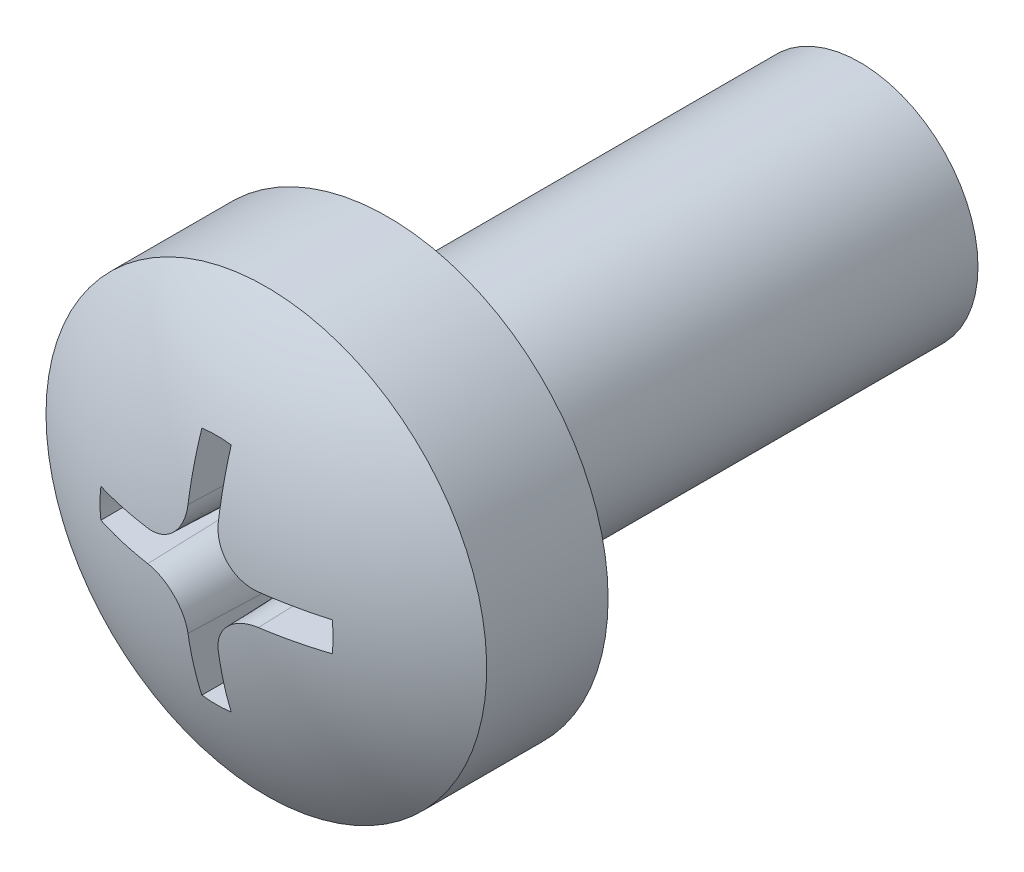
ISO-10303-21;
HEADER;
FILE_DESCRIPTION(('STEP AP214'),'2;1');
FILE_NAME('part.step','',(''),(''),'','','');
FILE_SCHEMA(('AUTOMOTIVE_DESIGN { 1 0 10303 214 1 1 1 1 }'));
ENDSEC;
DATA;
#1=APPLICATION_CONTEXT('core data for automotive mechanical design processes');
#2=APPLICATION_PROTOCOL_DEFINITION('international standard','automotive_design',2000,#1);
#3=PRODUCT_CONTEXT('',#1,'mechanical');
#4=PRODUCT('Part','Part','',(#3));
#5=PRODUCT_RELATED_PRODUCT_CATEGORY('part','',(#4));
#6=PRODUCT_DEFINITION_FORMATION('','',#4);
#7=PRODUCT_DEFINITION_CONTEXT('part definition',#1,'design');
#8=PRODUCT_DEFINITION('design','',#6,#7);
#9=PRODUCT_DEFINITION_SHAPE('','',#8);
#10=(LENGTH_UNIT() NAMED_UNIT(*) SI_UNIT(.MILLI.,.METRE.));
#11=(NAMED_UNIT(*) PLANE_ANGLE_UNIT() SI_UNIT($,.RADIAN.));
#12=(NAMED_UNIT(*) SI_UNIT($,.STERADIAN.) SOLID_ANGLE_UNIT());
#13=UNCERTAINTY_MEASURE_WITH_UNIT(LENGTH_MEASURE(1.E-05),#10,'distance_accuracy_value','');
#14=(GEOMETRIC_REPRESENTATION_CONTEXT(3) GLOBAL_UNCERTAINTY_ASSIGNED_CONTEXT((#13)) GLOBAL_UNIT_ASSIGNED_CONTEXT((#10,
#11,#12)) REPRESENTATION_CONTEXT('',''));
#15=CARTESIAN_POINT('',(0.,0.,0.));
#16=DIRECTION('',(0.,0.,1.));
#17=DIRECTION('',(1.,0.,0.));
#18=AXIS2_PLACEMENT_3D('',#15,#16,#17);
#19=CARTESIAN_POINT('',(0.,0.,6.));
#20=DIRECTION('',(0.,0.,-1.));
#21=DIRECTION('',(-1.,0.,0.));
#22=AXIS2_PLACEMENT_3D('',#19,#20,#21);
#23=CYLINDRICAL_SURFACE('',#22,1.5);
#24=CARTESIAN_POINT('',(0.,0.,6.));
#25=DIRECTION('',(0.,0.,1.));
#26=DIRECTION('',(1.,0.,0.));
#27=AXIS2_PLACEMENT_3D('',#24,#25,#26);
#28=CIRCLE('',#27,1.5);
#29=CARTESIAN_POINT('',(1.5,0.,6.));
#30=VERTEX_POINT('',#29);
#31=EDGE_CURVE('E206',#30,#30,#28,.T.);
#32=ORIENTED_EDGE('',*,*,#31,.F.);
#33=EDGE_LOOP('',(#32));
#34=FACE_BOUND('',#33,.T.);
#35=CARTESIAN_POINT('',(0.,0.,0.));
#36=DIRECTION('',(0.,0.,1.));
#37=DIRECTION('',(1.,0.,0.));
#38=AXIS2_PLACEMENT_3D('',#35,#36,#37);
#39=CIRCLE('',#38,1.5);
#40=CARTESIAN_POINT('',(1.5,0.,0.));
#41=VERTEX_POINT('',#40);
#42=EDGE_CURVE('E205',#41,#41,#39,.T.);
#43=ORIENTED_EDGE('',*,*,#42,.T.);
#44=EDGE_LOOP('',(#43));
#45=FACE_BOUND('',#44,.T.);
#46=ADVANCED_FACE('F34',(#34,#45),#23,.T.);
#47=CARTESIAN_POINT('',(0.,0.,0.));
#48=DIRECTION('',(0.,0.,1.));
#49=DIRECTION('',(1.,0.,0.));
#50=AXIS2_PLACEMENT_3D('',#47,#48,#49);
#51=PLANE('',#50);
#52=ORIENTED_EDGE('',*,*,#42,.F.);
#53=EDGE_LOOP('',(#52));
#54=FACE_BOUND('',#53,.T.);
#55=ADVANCED_FACE('F295',(#54),#51,.F.);
#56=CARTESIAN_POINT('',(0.,0.,6.));
#57=DIRECTION('',(0.,0.,-1.));
#58=DIRECTION('',(-1.,0.,0.));
#59=AXIS2_PLACEMENT_3D('',#56,#57,#58);
#60=PLANE('',#59);
#61=CARTESIAN_POINT('',(0.,0.,6.));
#62=DIRECTION('',(0.,0.,-1.));
#63=DIRECTION('',(-1.,0.,0.));
#64=AXIS2_PLACEMENT_3D('',#61,#62,#63);
#65=CIRCLE('',#64,2.79999990016222);
#66=CARTESIAN_POINT('',(-2.79999990016222,0.,6.));
#67=VERTEX_POINT('',#66);
#68=EDGE_CURVE('E202',#67,#67,#65,.T.);
#69=ORIENTED_EDGE('',*,*,#68,.T.);
#70=EDGE_LOOP('',(#69));
#71=FACE_BOUND('',#70,.T.);
#72=ORIENTED_EDGE('',*,*,#31,.T.);
#73=EDGE_LOOP('',(#72));
#74=FACE_BOUND('',#73,.T.);
#75=ADVANCED_FACE('F300',(#71,#74),#60,.T.);
#76=CARTESIAN_POINT('',(0.,0.,-0.393620134621003));
#77=DIRECTION('',(0.,0.,-1.));
#78=DIRECTION('',(-1.,0.,0.));
#79=AXIS2_PLACEMENT_3D('',#76,#77,#78);
#80=CYLINDRICAL_SURFACE('',#79,2.79999990016222);
#81=CARTESIAN_POINT('',(0.,0.,7.54246307978926));
#82=DIRECTION('',(0.,0.,-1.));
#83=DIRECTION('',(-1.,0.,0.));
#84=AXIS2_PLACEMENT_3D('',#81,#82,#83);
#85=CIRCLE('',#84,2.79999990016222);
#86=CARTESIAN_POINT('',(-2.79999990016222,0.,7.54246307978926));
#87=VERTEX_POINT('',#86);
#88=EDGE_CURVE('E150',#87,#87,#85,.T.);
#89=ORIENTED_EDGE('',*,*,#88,.T.);
#90=EDGE_LOOP('',(#89));
#91=FACE_BOUND('',#90,.T.);
#92=ORIENTED_EDGE('',*,*,#68,.F.);
#93=EDGE_LOOP('',(#92));
#94=FACE_BOUND('',#93,.T.);
#95=ADVANCED_FACE('F307',(#91,#94),#80,.T.);
#96=CARTESIAN_POINT('',(0.,0.,3.40000011175871));
#97=DIRECTION('',(0.,0.,-1.));
#98=DIRECTION('',(1.,0.,0.));
#99=AXIS2_PLACEMENT_3D('',#96,#97,#98);
#100=SPHERICAL_SURFACE('',#99,4.99999988824129);
#101=CARTESIAN_POINT('',(0.,0.,8.17541838215017));
#102=DIRECTION('',(0.,0.,-1.));
#103=DIRECTION('',(-1.,0.,0.));
#104=AXIS2_PLACEMENT_3D('',#101,#102,#103);
#105=CIRCLE('',#104,1.4816812157899);
#106=CARTESIAN_POINT('',(0.18668120666759,1.46987392394782,8.17541838215014));
#107=VERTEX_POINT('',#106);
#108=CARTESIAN_POINT('',(-0.186681206667593,1.46987392394782,8.17541838215014));
#109=VERTEX_POINT('',#108);
#110=EDGE_CURVE('E11',#107,#109,#105,.F.);
#111=ORIENTED_EDGE('',*,*,#110,.F.);
#112=CARTESIAN_POINT('',(0.0198956640512633,0.,3.39930533986049));
#113=DIRECTION('',(0.999390827019096,0.,-0.034899496702501));
#114=DIRECTION('',(-0.034899496702501,0.,-0.999390827019096));
#115=AXIS2_PLACEMENT_3D('',#112,#113,#114);
#116=CIRCLE('',#115,4.99996025606773);
#117=CARTESIAN_POINT('',(0.192632610704328,0.708178557647151,8.34584429553512));
#118=VERTEX_POINT('',#117);
#119=EDGE_CURVE('E41',#107,#118,#116,.T.);
#120=ORIENTED_EDGE('',*,*,#119,.T.);
#121=CARTESIAN_POINT('',(0.192631650862954,0.708378557647151,8.34581569147501));
#122=CARTESIAN_POINT('',(0.192737639690806,0.679822741796073,8.34990414397343));
#123=CARTESIAN_POINT('',(0.195268867839181,0.651227392830895,8.35364633624144));
#124=CARTESIAN_POINT('',(0.205046889209158,0.594767038274589,8.36034605517117));
#125=CARTESIAN_POINT('',(0.212292618678018,0.566901869404939,8.36330375862851));
#126=CARTESIAN_POINT('',(0.231373694375068,0.51267267841366,8.36834660632538));
#127=CARTESIAN_POINT('',(0.24321326807329,0.486310064716558,8.37043094316672));
#128=CARTESIAN_POINT('',(0.271156607880554,0.435900324544808,8.37366034910124));
#129=CARTESIAN_POINT('',(0.287258672100205,0.411852279143785,8.37480579232145));
#130=CARTESIAN_POINT('',(0.323072075489885,0.367028886470806,8.37611580257173));
#131=CARTESIAN_POINT('',(0.342740648168188,0.346219679514825,8.37629128935958));
#132=CARTESIAN_POINT('',(0.385246757538768,0.30814670944778,8.37568534569509));
#133=CARTESIAN_POINT('',(0.408084792807392,0.290883505206881,8.37490376453834));
#134=CARTESIAN_POINT('',(0.456147210008961,0.260464262414973,8.37241339517053));
#135=CARTESIAN_POINT('',(0.481359759209805,0.247289131136678,8.37070902247328));
#136=CARTESIAN_POINT('',(0.533541444049374,0.225283958921734,8.36642588708089));
#137=CARTESIAN_POINT('',(0.560509920861878,0.216452298826715,8.36384745082543));
#138=CARTESIAN_POINT('',(0.606876295057338,0.205379627868596,8.35882076515575));
#139=CARTESIAN_POINT('',(0.626020977094074,0.201943221890058,8.35658129607485));
#140=CARTESIAN_POINT('',(0.664502044043211,0.197253494550335,8.3517582366185));
#141=CARTESIAN_POINT('',(0.683838077649067,0.195996727127303,8.349175196413));
#142=CARTESIAN_POINT('',(0.703167546290468,0.195835015722444,8.34643346629546));
#143=B_SPLINE_CURVE_WITH_KNOTS('',3,(#121,#122,#123,#124,#125,#126,#127,#128,#129,#130,#131,
#132,#133,#134,#135,#136,#137,#138,#139,#140,#141,#142),.UNSPECIFIED.,.F.,.F.,(4,2,2,2,2,2,2,2,
2,2,4),(0.,0.0864417829586746,0.172864068455127,0.259366073122685,0.345833591994609,
0.431325646912079,0.516831165542017,0.601931114274005,0.686999315371811,0.745618262708562,
0.804144447281415),.UNSPECIFIED.);
#144=CARTESIAN_POINT('',(0.702917362553185,0.19583721033533,8.3464689381926));
#145=VERTEX_POINT('',#144);
#146=EDGE_CURVE('E277',#118,#145,#143,.T.);
#147=ORIENTED_EDGE('',*,*,#146,.T.);
#148=CARTESIAN_POINT('',(0.000105390153350939,0.0259265633149154,3.39909472873738));
#149=DIRECTION('',(0.00406243901494415,0.999382570249833,-0.034899496702501));
#150=DIRECTION('',(0.,0.0348997846864301,0.999390816962434));
#151=AXIS2_PLACEMENT_3D('',#148,#149,#150);
#152=CIRCLE('',#151,4.99993258603575);
#153=CARTESIAN_POINT('',(1.46986565043204,0.186746338396853,8.17541838215017));
#154=VERTEX_POINT('',#153);
#155=EDGE_CURVE('E275',#154,#145,#152,.F.);
#156=ORIENTED_EDGE('',*,*,#155,.F.);
#157=CARTESIAN_POINT('',(0.,0.,8.17541838215017));
#158=DIRECTION('',(0.,0.,-1.));
#159=DIRECTION('',(-1.,0.,0.));
#160=AXIS2_PLACEMENT_3D('',#157,#158,#159);
#161=CIRCLE('',#160,1.4816812157899);
#162=CARTESIAN_POINT('',(1.46986565043204,-0.186746338396852,8.17541838215014));
#163=VERTEX_POINT('',#162);
#164=EDGE_CURVE('E273',#163,#154,#161,.F.);
#165=ORIENTED_EDGE('',*,*,#164,.F.);
#166=CARTESIAN_POINT('',(0.000105390153350971,-0.0259265633149168,3.39909472873738));
#167=DIRECTION('',(0.00406243901494512,-0.999382570249833,-0.034899496702501));
#168=DIRECTION('',(0.,0.0348997846864301,-0.999390816962434));
#169=AXIS2_PLACEMENT_3D('',#166,#167,#168);
#170=CIRCLE('',#169,4.99993258603575);
#171=CARTESIAN_POINT('',(0.702917362553185,-0.195837210335331,8.3464689381926));
#172=VERTEX_POINT('',#171);
#173=EDGE_CURVE('E270',#163,#172,#170,.T.);
#174=ORIENTED_EDGE('',*,*,#173,.T.);
#175=CARTESIAN_POINT('',(0.192631650862954,-0.708378557647152,8.34581569147501));
#176=CARTESIAN_POINT('',(0.192737639690806,-0.679822741796074,8.34990414397343));
#177=CARTESIAN_POINT('',(0.195268867839181,-0.651227392830896,8.35364633624144));
#178=CARTESIAN_POINT('',(0.205046889209158,-0.59476703827459,8.36034605517117));
#179=CARTESIAN_POINT('',(0.212292618678018,-0.56690186940494,8.36330375862851));
#180=CARTESIAN_POINT('',(0.231373694375068,-0.512672678413661,8.36834660632538));
#181=CARTESIAN_POINT('',(0.24321326807329,-0.486310064716559,8.37043094316672));
#182=CARTESIAN_POINT('',(0.271156607880554,-0.435900324544809,8.37366034910124));
#183=CARTESIAN_POINT('',(0.287258672100205,-0.411852279143786,8.37480579232145));
#184=CARTESIAN_POINT('',(0.323072075489885,-0.367028886470807,8.37611580257173));
#185=CARTESIAN_POINT('',(0.342740648168188,-0.346219679514826,8.37629128935958));
#186=CARTESIAN_POINT('',(0.385246757538768,-0.30814670944778,8.37568534569509));
#187=CARTESIAN_POINT('',(0.408084792807392,-0.290883505206882,8.37490376453834));
#188=CARTESIAN_POINT('',(0.456147210008961,-0.260464262414974,8.37241339517053));
#189=CARTESIAN_POINT('',(0.481359759209805,-0.247289131136679,8.37070902247328));
#190=CARTESIAN_POINT('',(0.533541444049374,-0.225283958921735,8.36642588708089));
#191=CARTESIAN_POINT('',(0.560509920861877,-0.216452298826716,8.36384745082543));
#192=CARTESIAN_POINT('',(0.606876295057338,-0.205379627868597,8.35882076515575));
#193=CARTESIAN_POINT('',(0.626020977094074,-0.201943221890059,8.35658129607485));
#194=CARTESIAN_POINT('',(0.66450204404321,-0.197253494550336,8.3517582366185));
#195=CARTESIAN_POINT('',(0.683838077649067,-0.195996727127304,8.349175196413));
#196=CARTESIAN_POINT('',(0.703167546290467,-0.195835015722445,8.34643346629546));
#197=B_SPLINE_CURVE_WITH_KNOTS('',3,(#175,#176,#177,#178,#179,#180,#181,#182,#183,#184,#185,
#186,#187,#188,#189,#190,#191,#192,#193,#194,#195,#196),.UNSPECIFIED.,.F.,.F.,(4,2,2,2,2,2,2,2,
2,2,4),(0.,0.0864417829586746,0.172864068455127,0.259366073122685,0.345833591994609,
0.431325646912079,0.516831165542017,0.601931114274005,0.686999315371811,0.745618262708562,
0.804144447281415),.UNSPECIFIED.);
#198=CARTESIAN_POINT('',(0.192632610704328,-0.708178557647152,8.34584429553512));
#199=VERTEX_POINT('',#198);
#200=EDGE_CURVE('E264',#199,#172,#197,.T.);
#201=ORIENTED_EDGE('',*,*,#200,.F.);
#202=CARTESIAN_POINT('',(0.0198956640512633,0.,3.39930533986049));
#203=DIRECTION('',(0.999390827019096,0.,-0.034899496702501));
#204=DIRECTION('',(-0.034899496702501,0.,-0.999390827019096));
#205=AXIS2_PLACEMENT_3D('',#202,#203,#204);
#206=CIRCLE('',#205,4.99996025606773);
#207=CARTESIAN_POINT('',(0.186681206667591,-1.46987392394782,8.17541838215017));
#208=VERTEX_POINT('',#207);
#209=EDGE_CURVE('E262',#208,#199,#206,.F.);
#210=ORIENTED_EDGE('',*,*,#209,.F.);
#211=CARTESIAN_POINT('',(0.,0.,8.17541838215017));
#212=DIRECTION('',(0.,0.,-1.));
#213=DIRECTION('',(-1.,0.,0.));
#214=AXIS2_PLACEMENT_3D('',#211,#212,#213);
#215=CIRCLE('',#214,1.4816812157899);
#216=CARTESIAN_POINT('',(-0.186681206667593,-1.46987392394782,8.17541838215014));
#217=VERTEX_POINT('',#216);
#218=EDGE_CURVE('E259',#208,#217,#215,.T.);
#219=ORIENTED_EDGE('',*,*,#218,.T.);
#220=CARTESIAN_POINT('',(-0.0198956640512654,0.,3.39930533986049));
#221=DIRECTION('',(-0.999390827019096,0.,-0.034899496702501));
#222=DIRECTION('',(-0.034899496702501,0.,0.999390827019096));
#223=AXIS2_PLACEMENT_3D('',#220,#221,#222);
#224=CIRCLE('',#223,4.99996025606773);
#225=CARTESIAN_POINT('',(-0.19263261070433,-0.708178557647151,8.34584429553512));
#226=VERTEX_POINT('',#225);
#227=EDGE_CURVE('E255',#217,#226,#224,.T.);
#228=ORIENTED_EDGE('',*,*,#227,.T.);
#229=CARTESIAN_POINT('',(-0.70316754629047,-0.195835015722445,8.34643346629546));
#230=CARTESIAN_POINT('',(-0.674619447950853,-0.196052963217916,8.35048572416475));
#231=CARTESIAN_POINT('',(-0.64604143463723,-0.198695168407334,8.35418904161906));
#232=CARTESIAN_POINT('',(-0.589634494727846,-0.208689654905481,8.36080680147558));
#233=CARTESIAN_POINT('',(-0.561805393198952,-0.216040826152062,8.36372142956822));
#234=CARTESIAN_POINT('',(-0.50766612082123,-0.235323893103952,8.36867508610456));
#235=CARTESIAN_POINT('',(-0.481357369172765,-0.247259991703852,8.370713307523));
#236=CARTESIAN_POINT('',(-0.431071022991569,-0.275383990623327,8.37384890996341));
#237=CARTESIAN_POINT('',(-0.407092510169895,-0.291570206692358,8.37494666294437));
#238=CARTESIAN_POINT('',(-0.362416703115867,-0.327538701485094,8.37616180832018));
#239=CARTESIAN_POINT('',(-0.34168588735275,-0.347278991317759,8.37628996638402));
#240=CARTESIAN_POINT('',(-0.303780328011577,-0.389912448398922,8.37559036471605));
#241=CARTESIAN_POINT('',(-0.286606147147996,-0.412806113607388,8.37476245385545));
#242=CARTESIAN_POINT('',(-0.25636685808405,-0.460969475916929,8.37218162580557));
#243=CARTESIAN_POINT('',(-0.243283863198687,-0.486228184526672,8.37043282748058));
#244=CARTESIAN_POINT('',(-0.22146899790456,-0.538485231439468,8.36606389829698));
#245=CARTESIAN_POINT('',(-0.212735526227358,-0.565482925398504,8.36344408869266));
#246=CARTESIAN_POINT('',(-0.201823996880683,-0.61191361527353,8.35834781298739));
#247=CARTESIAN_POINT('',(-0.198453223120025,-0.631098599357625,8.3560784464194));
#248=CARTESIAN_POINT('',(-0.193901764340931,-0.669652448873598,8.35119687303864));
#249=CARTESIAN_POINT('',(-0.192717622166763,-0.689020975292663,8.34858521441869));
#250=CARTESIAN_POINT('',(-0.192631650862956,-0.708378557647151,8.34581569147501));
#251=B_SPLINE_CURVE_WITH_KNOTS('',3,(#229,#230,#231,#232,#233,#234,#235,#236,#237,#238,#239,
#240,#241,#242,#243,#244,#245,#246,#247,#248,#249,#250),.UNSPECIFIED.,.F.,.F.,(4,2,2,2,2,2,2,2,
2,2,4),(0.,0.0864053436114193,0.172790326060609,0.259254685287909,0.34568483171133,
0.431153892876567,0.51663646625136,0.601739908197796,0.686811996276178,0.745524819849982,
0.804144736260156),.UNSPECIFIED.);
#252=CARTESIAN_POINT('',(-0.702917362553187,-0.195837210335331,8.3464689381926));
#253=VERTEX_POINT('',#252);
#254=EDGE_CURVE('E248',#253,#226,#251,.T.);
#255=ORIENTED_EDGE('',*,*,#254,.F.);
#256=CARTESIAN_POINT('',(-0.000105390153349066,-0.0259265633149167,3.39909472873738));
#257=DIRECTION('',(-0.0040624390149453,-0.999382570249833,-0.034899496702501));
#258=DIRECTION('',(0.,0.0348997846864301,-0.999390816962434));
#259=AXIS2_PLACEMENT_3D('',#256,#257,#258);
#260=CIRCLE('',#259,4.99993258603575);
#261=CARTESIAN_POINT('',(-1.46986565043204,-0.186746338396853,8.17541838215019));
#262=VERTEX_POINT('',#261);
#263=EDGE_CURVE('E256',#262,#253,#260,.F.);
#264=ORIENTED_EDGE('',*,*,#263,.F.);
#265=CARTESIAN_POINT('',(0.,0.,8.17541838215019));
#266=DIRECTION('',(0.,0.,-1.));
#267=DIRECTION('',(-1.,0.,0.));
#268=AXIS2_PLACEMENT_3D('',#265,#266,#267);
#269=CIRCLE('',#268,1.4816812157899);
#270=CARTESIAN_POINT('',(-1.46986565043204,0.186746338396852,8.17541838215014));
#271=VERTEX_POINT('',#270);
#272=EDGE_CURVE('E594',#262,#271,#269,.T.);
#273=ORIENTED_EDGE('',*,*,#272,.T.);
#274=CARTESIAN_POINT('',(-0.000105390153349066,0.0259265633149167,3.39909472873738));
#275=DIRECTION('',(-0.00406243901494529,0.999382570249833,-0.034899496702501));
#276=DIRECTION('',(0.,0.0348997846864301,0.999390816962434));
#277=AXIS2_PLACEMENT_3D('',#274,#275,#276);
#278=CIRCLE('',#277,4.99993258603575);
#279=CARTESIAN_POINT('',(-0.702917362553187,0.195837210335331,8.3464689381926));
#280=VERTEX_POINT('',#279);
#281=EDGE_CURVE('E221',#271,#280,#278,.T.);
#282=ORIENTED_EDGE('',*,*,#281,.T.);
#283=CARTESIAN_POINT('',(-0.192631650862955,0.708378557647151,8.34581569147501));
#284=CARTESIAN_POINT('',(-0.192737639690808,0.679822741796074,8.34990414397343));
#285=CARTESIAN_POINT('',(-0.195268867839183,0.651227392830896,8.35364633624144));
#286=CARTESIAN_POINT('',(-0.20504688920916,0.59476703827459,8.36034605517116));
#287=CARTESIAN_POINT('',(-0.21229261867802,0.566901869404939,8.36330375862851));
#288=CARTESIAN_POINT('',(-0.231373694375069,0.51267267841366,8.36834660632538));
#289=CARTESIAN_POINT('',(-0.243213268073292,0.486310064716559,8.37043094316672));
#290=CARTESIAN_POINT('',(-0.271156607880556,0.435900324544809,8.37366034910124));
#291=CARTESIAN_POINT('',(-0.287258672100207,0.411852279143786,8.37480579232145));
#292=CARTESIAN_POINT('',(-0.323072075489887,0.367028886470806,8.37611580257173));
#293=CARTESIAN_POINT('',(-0.34274064816819,0.346219679514826,8.37629128935957));
#294=CARTESIAN_POINT('',(-0.38524675753877,0.30814670944778,8.37568534569509));
#295=CARTESIAN_POINT('',(-0.408084792807394,0.290883505206882,8.37490376453834));
#296=CARTESIAN_POINT('',(-0.456147210008963,0.260464262414974,8.37241339517053));
#297=CARTESIAN_POINT('',(-0.481359759209807,0.247289131136679,8.37070902247328));
#298=CARTESIAN_POINT('',(-0.533541444049376,0.225283958921735,8.36642588708089));
#299=CARTESIAN_POINT('',(-0.560509920861879,0.216452298826716,8.36384745082543));
#300=CARTESIAN_POINT('',(-0.60687629505734,0.205379627868597,8.35882076515575));
#301=CARTESIAN_POINT('',(-0.626020977094076,0.201943221890059,8.35658129607485));
#302=CARTESIAN_POINT('',(-0.664502044043212,0.197253494550336,8.3517582366185));
#303=CARTESIAN_POINT('',(-0.683838077649068,0.195996727127304,8.349175196413));
#304=CARTESIAN_POINT('',(-0.703167546290469,0.195835015722445,8.34643346629546));
#305=B_SPLINE_CURVE_WITH_KNOTS('',3,(#283,#284,#285,#286,#287,#288,#289,#290,#291,#292,#293,
#294,#295,#296,#297,#298,#299,#300,#301,#302,#303,#304),.UNSPECIFIED.,.F.,.F.,(4,2,2,2,2,2,2,2,
2,2,4),(0.,0.0864417829586747,0.172864068455127,0.259366073122684,0.345833591994609,
0.431325646912079,0.516831165542016,0.601931114274005,0.686999315371811,0.745618262708562,
0.804144447281415),.UNSPECIFIED.);
#306=CARTESIAN_POINT('',(-0.19263261070433,0.708178557647151,8.34584429553512));
#307=VERTEX_POINT('',#306);
#308=EDGE_CURVE('E213',#307,#280,#305,.T.);
#309=ORIENTED_EDGE('',*,*,#308,.F.);
#310=CARTESIAN_POINT('',(-0.0198956640512643,0.,3.39930533986049));
#311=DIRECTION('',(-0.999390827019096,0.,-0.034899496702501));
#312=DIRECTION('',(-0.034899496702501,0.,0.999390827019096));
#313=AXIS2_PLACEMENT_3D('',#310,#311,#312);
#314=CIRCLE('',#313,4.99996025606773);
#315=EDGE_CURVE('E209',#109,#307,#314,.F.);
#316=ORIENTED_EDGE('',*,*,#315,.F.);
#317=EDGE_LOOP('',(#111,#120,#147,#156,#165,#174,#201,#210,#219,#228,#255,#264,#273,#282,#309,#316));
#318=FACE_BOUND('',#317,.T.);
#319=ORIENTED_EDGE('',*,*,#88,.F.);
#320=EDGE_LOOP('',(#319));
#321=FACE_BOUND('',#320,.T.);
#322=ADVANCED_FACE('F223',(#318,#321),#100,.T.);
#323=CARTESIAN_POINT('',(0.,0.,8.7000001));
#324=DIRECTION('',(0.,0.,1.));
#325=DIRECTION('',(1.,0.,0.));
#326=AXIS2_PLACEMENT_3D('',#323,#324,#325);
#327=CONICAL_SURFACE('',#326,1.50000001303852,0.0349065850398867);
#328=ORIENTED_EDGE('',*,*,#110,.T.);
#329=CARTESIAN_POINT('',(-0.142142619910814,1.43009594495933,6.90000013091991));
#330=CARTESIAN_POINT('',(-0.152618658076336,1.43957885994155,7.19999461322929));
#331=CARTESIAN_POINT('',(-0.163094792502732,1.4489727928664,7.49999185208944));
#332=CARTESIAN_POINT('',(-0.184047253837866,1.46758269456637,8.09999184178282));
#333=CARTESIAN_POINT('',(-0.194523580746602,1.47679866334215,8.39999459261603));
#334=CARTESIAN_POINT('',(-0.205000003916213,1.48592565006124,8.7000001));
#335=B_SPLINE_CURVE_WITH_KNOTS('',3,(#329,#330,#331,#332,#333,#334),.UNSPECIFIED.,.F.,.F.,(4,2,
4),(0.,0.900981158642231,1.80196231389533),.UNSPECIFIED.);
#336=CARTESIAN_POINT('',(-0.142142619910814,1.43009594495933,6.90000013091991));
#337=VERTEX_POINT('',#336);
#338=EDGE_CURVE('E48',#337,#109,#335,.T.);
#339=ORIENTED_EDGE('',*,*,#338,.F.);
#340=CARTESIAN_POINT('',(0.,0.,6.90000013091991));
#341=DIRECTION('',(0.,0.,1.));
#342=DIRECTION('',(1.,0.,0.));
#343=AXIS2_PLACEMENT_3D('',#340,#341,#342);
#344=CIRCLE('',#343,1.43714262903312);
#345=CARTESIAN_POINT('',(0.142142619910811,1.43009594495933,6.90000013091991));
#346=VERTEX_POINT('',#345);
#347=EDGE_CURVE('E158',#346,#337,#344,.T.);
#348=ORIENTED_EDGE('',*,*,#347,.F.);
#349=CARTESIAN_POINT('',(0.142142619910811,1.43009594495933,6.90000013091991));
#350=CARTESIAN_POINT('',(0.152618658076333,1.43957885994155,7.19999461322929));
#351=CARTESIAN_POINT('',(0.16309479250273,1.4489727928664,7.49999185208944));
#352=CARTESIAN_POINT('',(0.184047253837863,1.46758269456637,8.09999184178282));
#353=CARTESIAN_POINT('',(0.1945235807466,1.47679866334215,8.39999459261603));
#354=CARTESIAN_POINT('',(0.205000003916211,1.48592565006124,8.7000001));
#355=B_SPLINE_CURVE_WITH_KNOTS('',3,(#349,#350,#351,#352,#353,#354),.UNSPECIFIED.,.F.,.F.,(4,2,
4),(0.,0.900981158642231,1.80196231389533),.UNSPECIFIED.);
#356=EDGE_CURVE('E142',#346,#107,#355,.T.);
#357=ORIENTED_EDGE('',*,*,#356,.T.);
#358=EDGE_LOOP('',(#328,#339,#348,#357));
#359=FACE_BOUND('',#358,.T.);
#360=ADVANCED_FACE('F162',(#359),#327,.F.);
#361=CARTESIAN_POINT('',(0.205000003916211,1.48592565006124,8.7000001));
#362=DIRECTION('',(0.999390827019096,0.,-0.034899496702501));
#363=DIRECTION('',(-0.034899496702501,0.,-0.999390827019096));
#364=AXIS2_PLACEMENT_3D('',#361,#362,#363);
#365=PLANE('',#364);
#366=ORIENTED_EDGE('',*,*,#356,.F.);
#367=DIRECTION('',(0.,1.,0.));
#368=VECTOR('',#367,1.);
#369=CARTESIAN_POINT('',(0.142142619910812,0.,6.90000013091991));
#370=LINE('',#369,#368);
#371=CARTESIAN_POINT('',(0.142142619910811,0.708178557647151,6.90000013091991));
#372=VERTEX_POINT('',#371);
#373=EDGE_CURVE('E145',#346,#372,#370,.F.);
#374=ORIENTED_EDGE('',*,*,#373,.T.);
#375=DIRECTION('',(0.034899496702501,0.,0.999390827019096));
#376=VECTOR('',#375,1.);
#377=CARTESIAN_POINT('',(0.20500000391621,0.708178557647151,8.7000001));
#378=LINE('',#377,#376);
#379=EDGE_CURVE('E151',#372,#118,#378,.T.);
#380=ORIENTED_EDGE('',*,*,#379,.T.);
#381=ORIENTED_EDGE('',*,*,#119,.F.);
#382=EDGE_LOOP('',(#366,#374,#380,#381));
#383=FACE_BOUND('',#382,.T.);
#384=ADVANCED_FACE('F144',(#383),#365,.F.);
#385=CARTESIAN_POINT('',(0.705000003916211,0.708178557647151,8.7000001));
#386=DIRECTION('',(0.,0.,-1.));
#387=DIRECTION('',(1.,0.,0.));
#388=AXIS2_PLACEMENT_3D('',#385,#386,#387);
#389=CONICAL_SURFACE('',#388,0.5,0.0349065850398867);
#390=ORIENTED_EDGE('',*,*,#379,.F.);
#391=CARTESIAN_POINT('',(0.705000003916211,0.708178557647151,6.90000013091991));
#392=DIRECTION('',(0.,0.,1.));
#393=DIRECTION('',(1.,0.,0.));
#394=AXIS2_PLACEMENT_3D('',#391,#392,#393);
#395=CIRCLE('',#394,0.562857384005399);
#396=CARTESIAN_POINT('',(0.702712036351556,0.145325823858085,6.90000013091991));
#397=VERTEX_POINT('',#396);
#398=EDGE_CURVE('E160',#372,#397,#395,.T.);
#399=ORIENTED_EDGE('',*,*,#398,.T.);
#400=DIRECTION('',(0.000141863496415148,0.0348992083697649,0.999390827019096));
#401=VECTOR('',#400,1.);
#402=CARTESIAN_POINT('',(0.702967546290468,0.208182688548215,8.7000001));
#403=LINE('',#402,#401);
#404=EDGE_CURVE('E420',#397,#145,#403,.T.);
#405=ORIENTED_EDGE('',*,*,#404,.T.);
#406=ORIENTED_EDGE('',*,*,#146,.F.);
#407=EDGE_LOOP('',(#390,#399,#405,#406));
#408=FACE_BOUND('',#407,.T.);
#409=ADVANCED_FACE('F283',(#408),#389,.T.);
#410=CARTESIAN_POINT('',(1.48592565006123,0.205000003916213,8.7000001));
#411=DIRECTION('',(0.00406243901494415,0.999382570249833,-0.034899496702501));
#412=DIRECTION('',(0.,0.0348997846864301,0.999390816962434));
#413=AXIS2_PLACEMENT_3D('',#410,#411,#412);
#414=PLANE('',#413);
#415=ORIENTED_EDGE('',*,*,#155,.T.);
#416=ORIENTED_EDGE('',*,*,#404,.F.);
#417=DIRECTION('',(-0.99999173819787,0.00406491525148502,0.));
#418=VECTOR('',#417,1.);
#419=CARTESIAN_POINT('',(0.000602343564913371,0.148179863836023,6.90000013091991));
#420=LINE('',#419,#418);
#421=CARTESIAN_POINT('',(1.43007341244828,0.142369137079488,6.90000013091991));
#422=VERTEX_POINT('',#421);
#423=EDGE_CURVE('E171',#422,#397,#420,.T.);
#424=ORIENTED_EDGE('',*,*,#423,.F.);
#425=CARTESIAN_POINT('',(1.43007341244828,0.142369137079488,6.90000013091991));
#426=CARTESIAN_POINT('',(1.43955869120937,0.152806706922151,7.19999467904414));
#427=CARTESIAN_POINT('',(1.44895568373278,0.163244730756208,7.49999195080733));
#428=CARTESIAN_POINT('',(1.46757309626977,0.184121686368453,8.09999194050071));
#429=CARTESIAN_POINT('',(1.47679351628402,0.194560618146638,8.39999465843089));
#430=CARTESIAN_POINT('',(1.48592565006123,0.205000003916213,8.7000001));
#431=B_SPLINE_CURVE_WITH_KNOTS('',3,(#425,#426,#427,#428,#429,#430),.UNSPECIFIED.,.F.,.F.,(4,2,
4),(0.,0.900977563471274,1.80195512360615),.UNSPECIFIED.);
#432=EDGE_CURVE('E414',#422,#154,#431,.T.);
#433=ORIENTED_EDGE('',*,*,#432,.T.);
#434=EDGE_LOOP('',(#415,#416,#424,#433));
#435=FACE_BOUND('',#434,.T.);
#436=ADVANCED_FACE('F235',(#435),#414,.F.);
#437=CARTESIAN_POINT('',(0.,0.,8.7000001));
#438=DIRECTION('',(0.,0.,1.));
#439=DIRECTION('',(1.,0.,0.));
#440=AXIS2_PLACEMENT_3D('',#437,#438,#439);
#441=CONICAL_SURFACE('',#440,1.50000001303852,0.0349065850398867);
#442=ORIENTED_EDGE('',*,*,#164,.T.);
#443=ORIENTED_EDGE('',*,*,#432,.F.);
#444=CARTESIAN_POINT('',(0.,0.,6.90000013091991));
#445=DIRECTION('',(0.,0.,1.));
#446=DIRECTION('',(1.,0.,0.));
#447=AXIS2_PLACEMENT_3D('',#444,#445,#446);
#448=CIRCLE('',#447,1.43714262903312);
#449=CARTESIAN_POINT('',(1.43007341244828,-0.142369137079488,6.90000013091991));
#450=VERTEX_POINT('',#449);
#451=EDGE_CURVE('E173',#450,#422,#448,.T.);
#452=ORIENTED_EDGE('',*,*,#451,.F.);
#453=CARTESIAN_POINT('',(1.43007341244828,-0.142369137079488,6.90000013091991));
#454=CARTESIAN_POINT('',(1.43955869120937,-0.152806706922151,7.19999467904414));
#455=CARTESIAN_POINT('',(1.44895568373278,-0.163244730756208,7.49999195080733));
#456=CARTESIAN_POINT('',(1.46757309626977,-0.184121686368453,8.09999194050071));
#457=CARTESIAN_POINT('',(1.47679351628402,-0.194560618146638,8.39999465843089));
#458=CARTESIAN_POINT('',(1.48592565006123,-0.205000003916213,8.7000001));
#459=B_SPLINE_CURVE_WITH_KNOTS('',3,(#453,#454,#455,#456,#457,#458),.UNSPECIFIED.,.F.,.F.,(4,2,
4),(0.,0.900977563471274,1.80195512360615),.UNSPECIFIED.);
#460=EDGE_CURVE('E408',#450,#163,#459,.T.);
#461=ORIENTED_EDGE('',*,*,#460,.T.);
#462=EDGE_LOOP('',(#442,#443,#452,#461));
#463=FACE_BOUND('',#462,.T.);
#464=ADVANCED_FACE('F291',(#463),#441,.F.);
#465=CARTESIAN_POINT('',(1.48592565006123,-0.205000003916213,8.7000001));
#466=DIRECTION('',(0.00406243901494512,-0.999382570249833,-0.034899496702501));
#467=DIRECTION('',(0.,0.0348997846864301,-0.999390816962434));
#468=AXIS2_PLACEMENT_3D('',#465,#466,#467);
#469=PLANE('',#468);
#470=ORIENTED_EDGE('',*,*,#460,.F.);
#471=DIRECTION('',(0.99999173819787,0.00406491525148599,0.));
#472=VECTOR('',#471,1.);
#473=CARTESIAN_POINT('',(0.00060234356491352,-0.148179863836024,6.90000013091991));
#474=LINE('',#473,#472);
#475=CARTESIAN_POINT('',(0.702712036351556,-0.145325823858086,6.90000013091991));
#476=VERTEX_POINT('',#475);
#477=EDGE_CURVE('E176',#450,#476,#474,.F.);
#478=ORIENTED_EDGE('',*,*,#477,.T.);
#479=DIRECTION('',(0.000141863496415188,-0.0348992083697649,0.999390827019096));
#480=VECTOR('',#479,1.);
#481=CARTESIAN_POINT('',(0.702967546290468,-0.208182688548216,8.7000001));
#482=LINE('',#481,#480);
#483=EDGE_CURVE('E430',#476,#172,#482,.T.);
#484=ORIENTED_EDGE('',*,*,#483,.T.);
#485=ORIENTED_EDGE('',*,*,#173,.F.);
#486=EDGE_LOOP('',(#470,#478,#484,#485));
#487=FACE_BOUND('',#486,.T.);
#488=ADVANCED_FACE('F403',(#487),#469,.F.);
#489=CARTESIAN_POINT('',(0.705000003916211,-0.708178557647152,8.7000001));
#490=DIRECTION('',(0.,0.,-1.));
#491=DIRECTION('',(-1.,0.,0.));
#492=AXIS2_PLACEMENT_3D('',#489,#490,#491);
#493=CONICAL_SURFACE('',#492,0.5,0.0349065850398867);
#494=ORIENTED_EDGE('',*,*,#200,.T.);
#495=ORIENTED_EDGE('',*,*,#483,.F.);
#496=CARTESIAN_POINT('',(0.705000003916211,-0.708178557647152,6.90000013091991));
#497=DIRECTION('',(0.,0.,1.));
#498=DIRECTION('',(1.,0.,0.));
#499=AXIS2_PLACEMENT_3D('',#496,#497,#498);
#500=CIRCLE('',#499,0.562857384005399);
#501=CARTESIAN_POINT('',(0.142142619910812,-0.708178557647152,6.90000013091991));
#502=VERTEX_POINT('',#501);
#503=EDGE_CURVE('E178',#502,#476,#500,.F.);
#504=ORIENTED_EDGE('',*,*,#503,.F.);
#505=DIRECTION('',(0.034899496702501,0.,0.999390827019096));
#506=VECTOR('',#505,1.);
#507=CARTESIAN_POINT('',(0.205000003916211,-0.708178557647152,8.7000001));
#508=LINE('',#507,#506);
#509=EDGE_CURVE('E394',#502,#199,#508,.T.);
#510=ORIENTED_EDGE('',*,*,#509,.T.);
#511=EDGE_LOOP('',(#494,#495,#504,#510));
#512=FACE_BOUND('',#511,.T.);
#513=ADVANCED_FACE('F245',(#512),#493,.T.);
#514=CARTESIAN_POINT('',(0.205000003916211,-1.48592565006124,8.7000001));
#515=DIRECTION('',(0.999390827019096,0.,-0.034899496702501));
#516=DIRECTION('',(-0.034899496702501,0.,-0.999390827019096));
#517=AXIS2_PLACEMENT_3D('',#514,#515,#516);
#518=PLANE('',#517);
#519=ORIENTED_EDGE('',*,*,#209,.T.);
#520=ORIENTED_EDGE('',*,*,#509,.F.);
#521=DIRECTION('',(0.,1.,0.));
#522=VECTOR('',#521,1.);
#523=CARTESIAN_POINT('',(0.142142619910812,0.,6.90000013091991));
#524=LINE('',#523,#522);
#525=CARTESIAN_POINT('',(0.142142619910811,-1.43009594495933,6.90000013091991));
#526=VERTEX_POINT('',#525);
#527=EDGE_CURVE('E181',#526,#502,#524,.T.);
#528=ORIENTED_EDGE('',*,*,#527,.F.);
#529=CARTESIAN_POINT('',(0.142142619910811,-1.43009594495933,6.90000013091991));
#530=CARTESIAN_POINT('',(0.152618658076333,-1.43957885994155,7.19999461322929));
#531=CARTESIAN_POINT('',(0.16309479250273,-1.4489727928664,7.49999185208944));
#532=CARTESIAN_POINT('',(0.184047253837863,-1.46758269456637,8.09999184178282));
#533=CARTESIAN_POINT('',(0.1945235807466,-1.47679866334215,8.39999459261603));
#534=CARTESIAN_POINT('',(0.205000003916211,-1.48592565006124,8.7000001));
#535=B_SPLINE_CURVE_WITH_KNOTS('',3,(#529,#530,#531,#532,#533,#534),.UNSPECIFIED.,.F.,.F.,(4,2,
4),(0.,0.900981158642231,1.80196231389533),.UNSPECIFIED.);
#536=EDGE_CURVE('E386',#526,#208,#535,.T.);
#537=ORIENTED_EDGE('',*,*,#536,.T.);
#538=EDGE_LOOP('',(#519,#520,#528,#537));
#539=FACE_BOUND('',#538,.T.);
#540=ADVANCED_FACE('F396',(#539),#518,.F.);
#541=CARTESIAN_POINT('',(0.,0.,8.7000001));
#542=DIRECTION('',(0.,0.,1.));
#543=DIRECTION('',(-1.,0.,0.));
#544=AXIS2_PLACEMENT_3D('',#541,#542,#543);
#545=CONICAL_SURFACE('',#544,1.50000001303852,0.0349065850398867);
#546=ORIENTED_EDGE('',*,*,#536,.F.);
#547=CARTESIAN_POINT('',(0.,0.,6.90000013091991));
#548=DIRECTION('',(0.,0.,1.));
#549=DIRECTION('',(1.,0.,0.));
#550=AXIS2_PLACEMENT_3D('',#547,#548,#549);
#551=CIRCLE('',#550,1.43714262903312);
#552=CARTESIAN_POINT('',(-0.142142619910814,-1.43009594495933,6.90000013091991));
#553=VERTEX_POINT('',#552);
#554=EDGE_CURVE('E184',#526,#553,#551,.F.);
#555=ORIENTED_EDGE('',*,*,#554,.T.);
#556=CARTESIAN_POINT('',(-0.142142619910814,-1.43009594495933,6.90000013091991));
#557=CARTESIAN_POINT('',(-0.152618658076336,-1.43957885994155,7.19999461322929));
#558=CARTESIAN_POINT('',(-0.163094792502732,-1.4489727928664,7.49999185208944));
#559=CARTESIAN_POINT('',(-0.184047253837866,-1.46758269456637,8.09999184178282));
#560=CARTESIAN_POINT('',(-0.194523580746602,-1.47679866334215,8.39999459261603));
#561=CARTESIAN_POINT('',(-0.205000003916213,-1.48592565006124,8.7000001));
#562=B_SPLINE_CURVE_WITH_KNOTS('',3,(#556,#557,#558,#559,#560,#561),.UNSPECIFIED.,.F.,.F.,(4,2,
4),(0.,0.900981158642231,1.80196231389533),.UNSPECIFIED.);
#563=EDGE_CURVE('E378',#553,#217,#562,.T.);
#564=ORIENTED_EDGE('',*,*,#563,.T.);
#565=ORIENTED_EDGE('',*,*,#218,.F.);
#566=EDGE_LOOP('',(#546,#555,#564,#565));
#567=FACE_BOUND('',#566,.T.);
#568=ADVANCED_FACE('F373',(#567),#545,.F.);
#569=CARTESIAN_POINT('',(-0.205000003916213,-1.48592565006124,8.7000001));
#570=DIRECTION('',(-0.999390827019096,0.,-0.034899496702501));
#571=DIRECTION('',(-0.034899496702501,0.,0.999390827019096));
#572=AXIS2_PLACEMENT_3D('',#569,#570,#571);
#573=PLANE('',#572);
#574=ORIENTED_EDGE('',*,*,#563,.F.);
#575=DIRECTION('',(0.,-1.,0.));
#576=VECTOR('',#575,1.);
#577=CARTESIAN_POINT('',(-0.142142619910814,0.,6.90000013091991));
#578=LINE('',#577,#576);
#579=CARTESIAN_POINT('',(-0.142142619910814,-0.708178557647151,6.90000013091991));
#580=VERTEX_POINT('',#579);
#581=EDGE_CURVE('E186',#553,#580,#578,.F.);
#582=ORIENTED_EDGE('',*,*,#581,.T.);
#583=DIRECTION('',(-0.034899496702501,0.,0.999390827019096));
#584=VECTOR('',#583,1.);
#585=CARTESIAN_POINT('',(-0.205000003916213,-0.708178557647151,8.7000001));
#586=LINE('',#585,#584);
#587=EDGE_CURVE('E387',#580,#226,#586,.T.);
#588=ORIENTED_EDGE('',*,*,#587,.T.);
#589=ORIENTED_EDGE('',*,*,#227,.F.);
#590=EDGE_LOOP('',(#574,#582,#588,#589));
#591=FACE_BOUND('',#590,.T.);
#592=ADVANCED_FACE('F243',(#591),#573,.F.);
#593=CARTESIAN_POINT('',(-0.705000003916213,-0.708178557647151,8.7000001));
#594=DIRECTION('',(0.,0.,-1.));
#595=DIRECTION('',(-1.,0.,0.));
#596=AXIS2_PLACEMENT_3D('',#593,#594,#595);
#597=CONICAL_SURFACE('',#596,0.5,0.0349065850398867);
#598=ORIENTED_EDGE('',*,*,#254,.T.);
#599=ORIENTED_EDGE('',*,*,#587,.F.);
#600=CARTESIAN_POINT('',(-0.705000003916213,-0.708178557647151,6.90000013091991));
#601=DIRECTION('',(0.,0.,1.));
#602=DIRECTION('',(1.,0.,0.));
#603=AXIS2_PLACEMENT_3D('',#600,#601,#602);
#604=CIRCLE('',#603,0.562857384005399);
#605=CARTESIAN_POINT('',(-0.702712036351558,-0.145325823858086,6.90000013091991));
#606=VERTEX_POINT('',#605);
#607=EDGE_CURVE('E188',#606,#580,#604,.F.);
#608=ORIENTED_EDGE('',*,*,#607,.F.);
#609=DIRECTION('',(-0.000141863496415188,-0.0348992083697649,0.999390827019096));
#610=VECTOR('',#609,1.);
#611=CARTESIAN_POINT('',(-0.70296754629047,-0.208182688548216,8.7000001));
#612=LINE('',#611,#610);
#613=EDGE_CURVE('E586',#606,#253,#612,.T.);
#614=ORIENTED_EDGE('',*,*,#613,.T.);
#615=EDGE_LOOP('',(#598,#599,#608,#614));
#616=FACE_BOUND('',#615,.T.);
#617=ADVANCED_FACE('F238',(#616),#597,.T.);
#618=CARTESIAN_POINT('',(-1.48592565006124,-0.205000003916213,8.7000001));
#619=DIRECTION('',(-0.0040624390149453,-0.999382570249833,-0.034899496702501));
#620=DIRECTION('',(0.,0.0348997846864301,-0.999390816962434));
#621=AXIS2_PLACEMENT_3D('',#618,#619,#620);
#622=PLANE('',#621);
#623=ORIENTED_EDGE('',*,*,#263,.T.);
#624=ORIENTED_EDGE('',*,*,#613,.F.);
#625=DIRECTION('',(0.99999173819787,-0.00406491525148617,0.));
#626=VECTOR('',#625,1.);
#627=CARTESIAN_POINT('',(-0.000602343564913546,-0.148179863836024,6.90000013091991));
#628=LINE('',#627,#626);
#629=CARTESIAN_POINT('',(-1.43007341244828,-0.142369137079487,6.90000013091991));
#630=VERTEX_POINT('',#629);
#631=EDGE_CURVE('E191',#630,#606,#628,.T.);
#632=ORIENTED_EDGE('',*,*,#631,.F.);
#633=CARTESIAN_POINT('',(-1.43007341244828,-0.142369137079487,6.90000013091991));
#634=CARTESIAN_POINT('',(-1.43955869120937,-0.152806706922151,7.19999467904414));
#635=CARTESIAN_POINT('',(-1.44895568373278,-0.163244730756207,7.49999195080733));
#636=CARTESIAN_POINT('',(-1.46757309626978,-0.184121686368453,8.09999194050071));
#637=CARTESIAN_POINT('',(-1.47679351628402,-0.194560618146638,8.39999465843089));
#638=CARTESIAN_POINT('',(-1.48592565006124,-0.205000003916213,8.7000001));
#639=B_SPLINE_CURVE_WITH_KNOTS('',3,(#633,#634,#635,#636,#637,#638),.UNSPECIFIED.,.F.,.F.,(4,2,
4),(0.,0.900977563471274,1.80195512360615),.UNSPECIFIED.);
#640=EDGE_CURVE('E353',#630,#262,#639,.T.);
#641=ORIENTED_EDGE('',*,*,#640,.T.);
#642=EDGE_LOOP('',(#623,#624,#632,#641));
#643=FACE_BOUND('',#642,.T.);
#644=ADVANCED_FACE('F242',(#643),#622,.F.);
#645=CARTESIAN_POINT('',(0.,0.,8.7000001));
#646=DIRECTION('',(0.,0.,1.));
#647=DIRECTION('',(-1.,0.,0.));
#648=AXIS2_PLACEMENT_3D('',#645,#646,#647);
#649=CONICAL_SURFACE('',#648,1.50000001303852,0.0349065850398867);
#650=ORIENTED_EDGE('',*,*,#640,.F.);
#651=CARTESIAN_POINT('',(0.,0.,6.90000013091991));
#652=DIRECTION('',(0.,0.,1.));
#653=DIRECTION('',(1.,0.,0.));
#654=AXIS2_PLACEMENT_3D('',#651,#652,#653);
#655=CIRCLE('',#654,1.43714262903312);
#656=CARTESIAN_POINT('',(-1.43007341244828,0.142369137079487,6.90000013091991));
#657=VERTEX_POINT('',#656);
#658=EDGE_CURVE('E194',#630,#657,#655,.F.);
#659=ORIENTED_EDGE('',*,*,#658,.T.);
#660=CARTESIAN_POINT('',(-1.43007341244828,0.142369137079487,6.90000013091991));
#661=CARTESIAN_POINT('',(-1.43955869120937,0.152806706922151,7.19999467904414));
#662=CARTESIAN_POINT('',(-1.44895568373278,0.163244730756207,7.49999195080733));
#663=CARTESIAN_POINT('',(-1.46757309626978,0.184121686368453,8.09999194050071));
#664=CARTESIAN_POINT('',(-1.47679351628402,0.194560618146638,8.39999465843089));
#665=CARTESIAN_POINT('',(-1.48592565006124,0.205000003916213,8.7000001));
#666=B_SPLINE_CURVE_WITH_KNOTS('',3,(#660,#661,#662,#663,#664,#665),.UNSPECIFIED.,.F.,.F.,(4,2,
4),(0.,0.900977563471274,1.80195512360615),.UNSPECIFIED.);
#667=EDGE_CURVE('E336',#657,#271,#666,.T.);
#668=ORIENTED_EDGE('',*,*,#667,.T.);
#669=ORIENTED_EDGE('',*,*,#272,.F.);
#670=EDGE_LOOP('',(#650,#659,#668,#669));
#671=FACE_BOUND('',#670,.T.);
#672=ADVANCED_FACE('F361',(#671),#649,.F.);
#673=CARTESIAN_POINT('',(-1.48592565006124,0.205000003916213,8.7000001));
#674=DIRECTION('',(-0.00406243901494529,0.999382570249833,-0.034899496702501));
#675=DIRECTION('',(0.,0.0348997846864301,0.999390816962434));
#676=AXIS2_PLACEMENT_3D('',#673,#674,#675);
#677=PLANE('',#676);
#678=ORIENTED_EDGE('',*,*,#667,.F.);
#679=DIRECTION('',(-0.99999173819787,-0.00406491525148616,0.));
#680=VECTOR('',#679,1.);
#681=CARTESIAN_POINT('',(-0.000602343564913545,0.148179863836024,6.90000013091991));
#682=LINE('',#681,#680);
#683=CARTESIAN_POINT('',(-0.702712036351557,0.145325823858086,6.90000013091991));
#684=VERTEX_POINT('',#683);
#685=EDGE_CURVE('E196',#657,#684,#682,.F.);
#686=ORIENTED_EDGE('',*,*,#685,.T.);
#687=DIRECTION('',(-0.000141863496415188,0.0348992083697649,0.999390827019096));
#688=VECTOR('',#687,1.);
#689=CARTESIAN_POINT('',(-0.702967546290469,0.208182688548216,8.7000001));
#690=LINE('',#689,#688);
#691=EDGE_CURVE('E334',#684,#280,#690,.T.);
#692=ORIENTED_EDGE('',*,*,#691,.T.);
#693=ORIENTED_EDGE('',*,*,#281,.F.);
#694=EDGE_LOOP('',(#678,#686,#692,#693));
#695=FACE_BOUND('',#694,.T.);
#696=ADVANCED_FACE('F233',(#695),#677,.F.);
#697=CARTESIAN_POINT('',(-0.705000003916212,0.708178557647151,8.7000001));
#698=DIRECTION('',(0.,0.,-1.));
#699=DIRECTION('',(-1.,0.,0.));
#700=AXIS2_PLACEMENT_3D('',#697,#698,#699);
#701=CONICAL_SURFACE('',#700,0.5,0.0349065850398867);
#702=ORIENTED_EDGE('',*,*,#308,.T.);
#703=ORIENTED_EDGE('',*,*,#691,.F.);
#704=CARTESIAN_POINT('',(-0.705000003916212,0.708178557647151,6.90000013091991));
#705=DIRECTION('',(0.,0.,1.));
#706=DIRECTION('',(1.,0.,0.));
#707=AXIS2_PLACEMENT_3D('',#704,#705,#706);
#708=CIRCLE('',#707,0.562857384005399);
#709=CARTESIAN_POINT('',(-0.142142619910813,0.708178557647151,6.90000013091991));
#710=VERTEX_POINT('',#709);
#711=EDGE_CURVE('E165',#710,#684,#708,.F.);
#712=ORIENTED_EDGE('',*,*,#711,.F.);
#713=DIRECTION('',(-0.034899496702501,0.,0.999390827019096));
#714=VECTOR('',#713,1.);
#715=CARTESIAN_POINT('',(-0.205000003916212,0.708178557647151,8.7000001));
#716=LINE('',#715,#714);
#717=EDGE_CURVE('E330',#710,#307,#716,.T.);
#718=ORIENTED_EDGE('',*,*,#717,.T.);
#719=EDGE_LOOP('',(#702,#703,#712,#718));
#720=FACE_BOUND('',#719,.T.);
#721=ADVANCED_FACE('F227',(#720),#701,.T.);
#722=CARTESIAN_POINT('',(-0.205000003916213,1.48592565006124,8.7000001));
#723=DIRECTION('',(-0.999390827019096,0.,-0.034899496702501));
#724=DIRECTION('',(-0.034899496702501,0.,0.999390827019096));
#725=AXIS2_PLACEMENT_3D('',#722,#723,#724);
#726=PLANE('',#725);
#727=ORIENTED_EDGE('',*,*,#315,.T.);
#728=ORIENTED_EDGE('',*,*,#717,.F.);
#729=DIRECTION('',(0.,-1.,0.));
#730=VECTOR('',#729,1.);
#731=CARTESIAN_POINT('',(-0.142142619910813,0.,6.90000013091991));
#732=LINE('',#731,#730);
#733=EDGE_CURVE('E163',#337,#710,#732,.T.);
#734=ORIENTED_EDGE('',*,*,#733,.F.);
#735=ORIENTED_EDGE('',*,*,#338,.T.);
#736=EDGE_LOOP('',(#727,#728,#734,#735));
#737=FACE_BOUND('',#736,.T.);
#738=ADVANCED_FACE('F232',(#737),#726,.F.);
#739=CARTESIAN_POINT('',(0.,0.,6.90000013091991));
#740=DIRECTION('',(0.,0.,1.));
#741=DIRECTION('',(1.,0.,0.));
#742=AXIS2_PLACEMENT_3D('',#739,#740,#741);
#743=PLANE('',#742);
#744=ORIENTED_EDGE('',*,*,#347,.T.);
#745=ORIENTED_EDGE('',*,*,#733,.T.);
#746=ORIENTED_EDGE('',*,*,#711,.T.);
#747=ORIENTED_EDGE('',*,*,#685,.F.);
#748=ORIENTED_EDGE('',*,*,#658,.F.);
#749=ORIENTED_EDGE('',*,*,#631,.T.);
#750=ORIENTED_EDGE('',*,*,#607,.T.);
#751=ORIENTED_EDGE('',*,*,#581,.F.);
#752=ORIENTED_EDGE('',*,*,#554,.F.);
#753=ORIENTED_EDGE('',*,*,#527,.T.);
#754=ORIENTED_EDGE('',*,*,#503,.T.);
#755=ORIENTED_EDGE('',*,*,#477,.F.);
#756=ORIENTED_EDGE('',*,*,#451,.T.);
#757=ORIENTED_EDGE('',*,*,#423,.T.);
#758=ORIENTED_EDGE('',*,*,#398,.F.);
#759=ORIENTED_EDGE('',*,*,#373,.F.);
#760=EDGE_LOOP('',(#744,#745,#746,#747,#748,#749,#750,#751,#752,#753,#754,#755,#756,#757,#758,#759));
#761=FACE_BOUND('',#760,.T.);
#762=ADVANCED_FACE('F156',(#761),#743,.T.);
#763=CLOSED_SHELL('',(#46,#55,#75,#95,#322,#360,#384,#409,#436,#464,#488,#513,#540,#568,#592,
#617,#644,#672,#696,#721,#738,#762));
#764=MANIFOLD_SOLID_BREP('B2',#763);
#765=ADVANCED_BREP_SHAPE_REPRESENTATION('',(#18,#764),#14);
#766=SHAPE_DEFINITION_REPRESENTATION(#9,#765);
ENDSEC;
END-ISO-10303-21;
